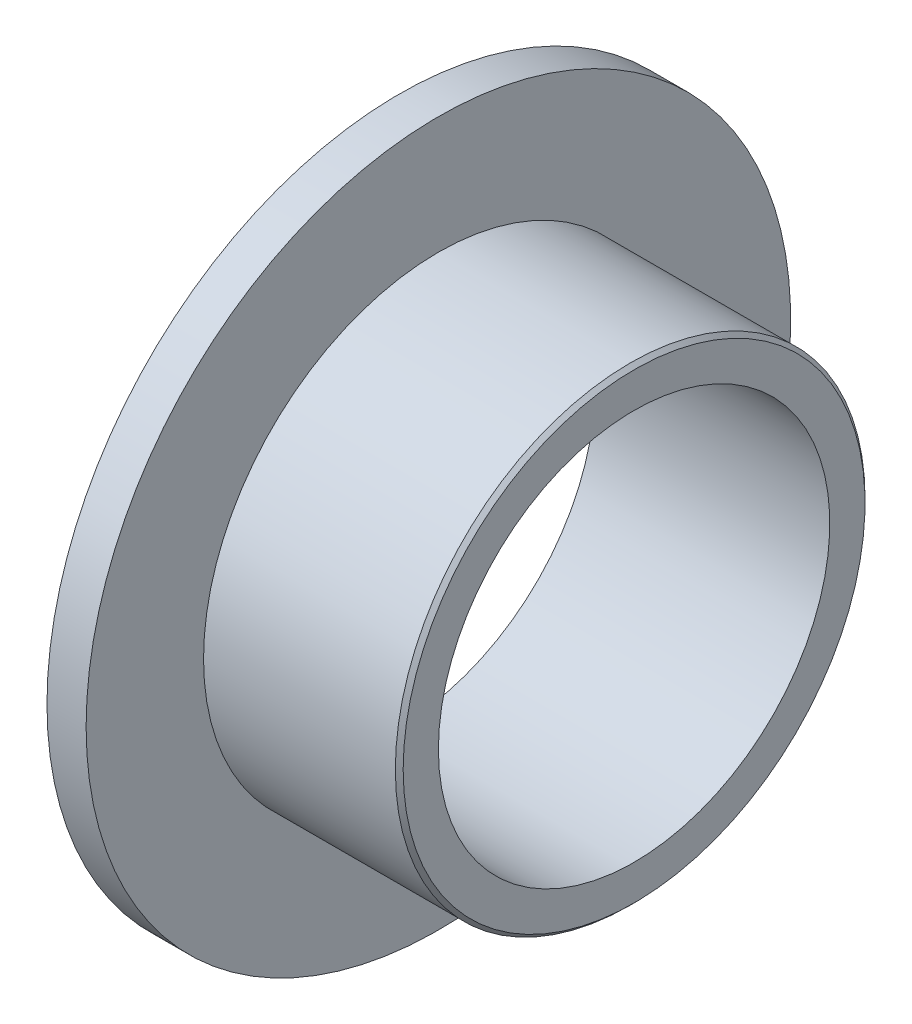
ISO-10303-21;
HEADER;
FILE_DESCRIPTION(('STEP AP214'),'2;1');
FILE_NAME('part.step','',(''),(''),'','','');
FILE_SCHEMA(('AUTOMOTIVE_DESIGN { 1 0 10303 214 1 1 1 1 }'));
ENDSEC;
DATA;
#1=APPLICATION_CONTEXT('core data for automotive mechanical design processes');
#2=APPLICATION_PROTOCOL_DEFINITION('international standard','automotive_design',2000,#1);
#3=PRODUCT_CONTEXT('',#1,'mechanical');
#4=PRODUCT('Part','Part','',(#3));
#5=PRODUCT_RELATED_PRODUCT_CATEGORY('part','',(#4));
#6=PRODUCT_DEFINITION_FORMATION('','',#4);
#7=PRODUCT_DEFINITION_CONTEXT('part definition',#1,'design');
#8=PRODUCT_DEFINITION('design','',#6,#7);
#9=PRODUCT_DEFINITION_SHAPE('','',#8);
#10=(LENGTH_UNIT() NAMED_UNIT(*) SI_UNIT(.MILLI.,.METRE.));
#11=(NAMED_UNIT(*) PLANE_ANGLE_UNIT() SI_UNIT($,.RADIAN.));
#12=(NAMED_UNIT(*) SI_UNIT($,.STERADIAN.) SOLID_ANGLE_UNIT());
#13=UNCERTAINTY_MEASURE_WITH_UNIT(LENGTH_MEASURE(1.E-05),#10,'distance_accuracy_value','');
#14=(GEOMETRIC_REPRESENTATION_CONTEXT(3) GLOBAL_UNCERTAINTY_ASSIGNED_CONTEXT((#13)) GLOBAL_UNIT_ASSIGNED_CONTEXT((#10,
#11,#12)) REPRESENTATION_CONTEXT('',''));
#15=CARTESIAN_POINT('',(0.,0.,0.));
#16=DIRECTION('',(0.,0.,1.));
#17=DIRECTION('',(1.,0.,0.));
#18=AXIS2_PLACEMENT_3D('',#15,#16,#17);
#19=CARTESIAN_POINT('',(0.,5.,0.));
#20=DIRECTION('',(-1.,0.,0.));
#21=DIRECTION('',(0.,0.,1.));
#22=AXIS2_PLACEMENT_3D('',#19,#20,#21);
#23=PLANE('',#22);
#24=CARTESIAN_POINT('',(0.,0.,0.));
#25=DIRECTION('',(-1.,0.,0.));
#26=DIRECTION('',(0.,0.,1.));
#27=AXIS2_PLACEMENT_3D('',#24,#25,#26);
#28=CIRCLE('',#27,9.);
#29=CARTESIAN_POINT('',(0.,0.,9.));
#30=VERTEX_POINT('',#29);
#31=EDGE_CURVE('E10',#30,#30,#28,.T.);
#32=ORIENTED_EDGE('',*,*,#31,.T.);
#33=EDGE_LOOP('',(#32));
#34=FACE_BOUND('',#33,.T.);
#35=CARTESIAN_POINT('',(0.,0.,0.));
#36=DIRECTION('',(-1.,0.,0.));
#37=DIRECTION('',(0.,0.,1.));
#38=AXIS2_PLACEMENT_3D('',#35,#36,#37);
#39=CIRCLE('',#38,5.);
#40=CARTESIAN_POINT('',(0.,0.,5.));
#41=VERTEX_POINT('',#40);
#42=EDGE_CURVE('E59',#41,#41,#39,.T.);
#43=ORIENTED_EDGE('',*,*,#42,.F.);
#44=EDGE_LOOP('',(#43));
#45=FACE_BOUND('',#44,.T.);
#46=ADVANCED_FACE('F34',(#34,#45),#23,.T.);
#47=CARTESIAN_POINT('',(4.,0.,0.));
#48=DIRECTION('',(-1.,0.,0.));
#49=DIRECTION('',(0.,0.,1.));
#50=AXIS2_PLACEMENT_3D('',#47,#48,#49);
#51=CYLINDRICAL_SURFACE('',#50,9.);
#52=CARTESIAN_POINT('',(1.,0.,0.));
#53=DIRECTION('',(-1.,0.,0.));
#54=DIRECTION('',(0.,0.,1.));
#55=AXIS2_PLACEMENT_3D('',#52,#53,#54);
#56=CIRCLE('',#55,9.);
#57=CARTESIAN_POINT('',(1.,0.,9.));
#58=VERTEX_POINT('',#57);
#59=EDGE_CURVE('E40',#58,#58,#56,.T.);
#60=ORIENTED_EDGE('',*,*,#59,.T.);
#61=EDGE_LOOP('',(#60));
#62=FACE_BOUND('',#61,.T.);
#63=ORIENTED_EDGE('',*,*,#31,.F.);
#64=EDGE_LOOP('',(#63));
#65=FACE_BOUND('',#64,.T.);
#66=ADVANCED_FACE('F67',(#62,#65),#51,.T.);
#67=CARTESIAN_POINT('',(1.,9.,0.));
#68=DIRECTION('',(1.,0.,0.));
#69=DIRECTION('',(0.,0.,-1.));
#70=AXIS2_PLACEMENT_3D('',#67,#68,#69);
#71=PLANE('',#70);
#72=CARTESIAN_POINT('',(1.,0.,0.));
#73=DIRECTION('',(-1.,0.,0.));
#74=DIRECTION('',(0.,0.,1.));
#75=AXIS2_PLACEMENT_3D('',#72,#73,#74);
#76=CIRCLE('',#75,6.);
#77=CARTESIAN_POINT('',(1.,0.,6.));
#78=VERTEX_POINT('',#77);
#79=EDGE_CURVE('E44',#78,#78,#76,.T.);
#80=ORIENTED_EDGE('',*,*,#79,.T.);
#81=EDGE_LOOP('',(#80));
#82=FACE_BOUND('',#81,.T.);
#83=ORIENTED_EDGE('',*,*,#59,.F.);
#84=EDGE_LOOP('',(#83));
#85=FACE_BOUND('',#84,.T.);
#86=ADVANCED_FACE('F71',(#82,#85),#71,.T.);
#87=CARTESIAN_POINT('',(4.,0.,0.));
#88=DIRECTION('',(-1.,0.,0.));
#89=DIRECTION('',(0.,0.,1.));
#90=AXIS2_PLACEMENT_3D('',#87,#88,#89);
#91=CYLINDRICAL_SURFACE('',#90,6.);
#92=CARTESIAN_POINT('',(5.9,0.,0.));
#93=DIRECTION('',(-1.,0.,0.));
#94=DIRECTION('',(0.,0.,1.));
#95=AXIS2_PLACEMENT_3D('',#92,#93,#94);
#96=CIRCLE('',#95,6.);
#97=CARTESIAN_POINT('',(5.9,0.,6.));
#98=VERTEX_POINT('',#97);
#99=EDGE_CURVE('E48',#98,#98,#96,.T.);
#100=ORIENTED_EDGE('',*,*,#99,.T.);
#101=EDGE_LOOP('',(#100));
#102=FACE_BOUND('',#101,.T.);
#103=ORIENTED_EDGE('',*,*,#79,.F.);
#104=EDGE_LOOP('',(#103));
#105=FACE_BOUND('',#104,.T.);
#106=ADVANCED_FACE('F75',(#102,#105),#91,.T.);
#107=CARTESIAN_POINT('',(5.9,0.,0.));
#108=DIRECTION('',(-1.,0.,0.));
#109=DIRECTION('',(0.,0.,1.));
#110=AXIS2_PLACEMENT_3D('',#107,#108,#109);
#111=CONICAL_SURFACE('',#110,6.,0.785398163397457);
#112=CARTESIAN_POINT('',(6.,0.,0.));
#113=DIRECTION('',(-1.,0.,0.));
#114=DIRECTION('',(0.,0.,1.));
#115=AXIS2_PLACEMENT_3D('',#112,#113,#114);
#116=CIRCLE('',#115,5.9);
#117=CARTESIAN_POINT('',(6.,0.,5.9));
#118=VERTEX_POINT('',#117);
#119=EDGE_CURVE('E53',#118,#118,#116,.T.);
#120=ORIENTED_EDGE('',*,*,#119,.T.);
#121=EDGE_LOOP('',(#120));
#122=FACE_BOUND('',#121,.T.);
#123=ORIENTED_EDGE('',*,*,#99,.F.);
#124=EDGE_LOOP('',(#123));
#125=FACE_BOUND('',#124,.T.);
#126=ADVANCED_FACE('F82',(#122,#125),#111,.T.);
#127=CARTESIAN_POINT('',(6.,5.9,0.));
#128=DIRECTION('',(1.,0.,0.));
#129=DIRECTION('',(0.,0.,-1.));
#130=AXIS2_PLACEMENT_3D('',#127,#128,#129);
#131=PLANE('',#130);
#132=CARTESIAN_POINT('',(6.,0.,0.));
#133=DIRECTION('',(-1.,0.,0.));
#134=DIRECTION('',(0.,0.,1.));
#135=AXIS2_PLACEMENT_3D('',#132,#133,#134);
#136=CIRCLE('',#135,5.);
#137=CARTESIAN_POINT('',(6.,0.,5.));
#138=VERTEX_POINT('',#137);
#139=EDGE_CURVE('E56',#138,#138,#136,.T.);
#140=ORIENTED_EDGE('',*,*,#139,.T.);
#141=EDGE_LOOP('',(#140));
#142=FACE_BOUND('',#141,.T.);
#143=ORIENTED_EDGE('',*,*,#119,.F.);
#144=EDGE_LOOP('',(#143));
#145=FACE_BOUND('',#144,.T.);
#146=ADVANCED_FACE('F86',(#142,#145),#131,.T.);
#147=CARTESIAN_POINT('',(4.,0.,0.));
#148=DIRECTION('',(-1.,0.,0.));
#149=DIRECTION('',(0.,0.,1.));
#150=AXIS2_PLACEMENT_3D('',#147,#148,#149);
#151=CYLINDRICAL_SURFACE('',#150,5.);
#152=ORIENTED_EDGE('',*,*,#42,.T.);
#153=EDGE_LOOP('',(#152));
#154=FACE_BOUND('',#153,.T.);
#155=ORIENTED_EDGE('',*,*,#139,.F.);
#156=EDGE_LOOP('',(#155));
#157=FACE_BOUND('',#156,.T.);
#158=ADVANCED_FACE('F63',(#154,#157),#151,.F.);
#159=CLOSED_SHELL('',(#46,#66,#86,#106,#126,#146,#158));
#160=MANIFOLD_SOLID_BREP('B2',#159);
#161=ADVANCED_BREP_SHAPE_REPRESENTATION('',(#18,#160),#14);
#162=SHAPE_DEFINITION_REPRESENTATION(#9,#161);
ENDSEC;
END-ISO-10303-21;
